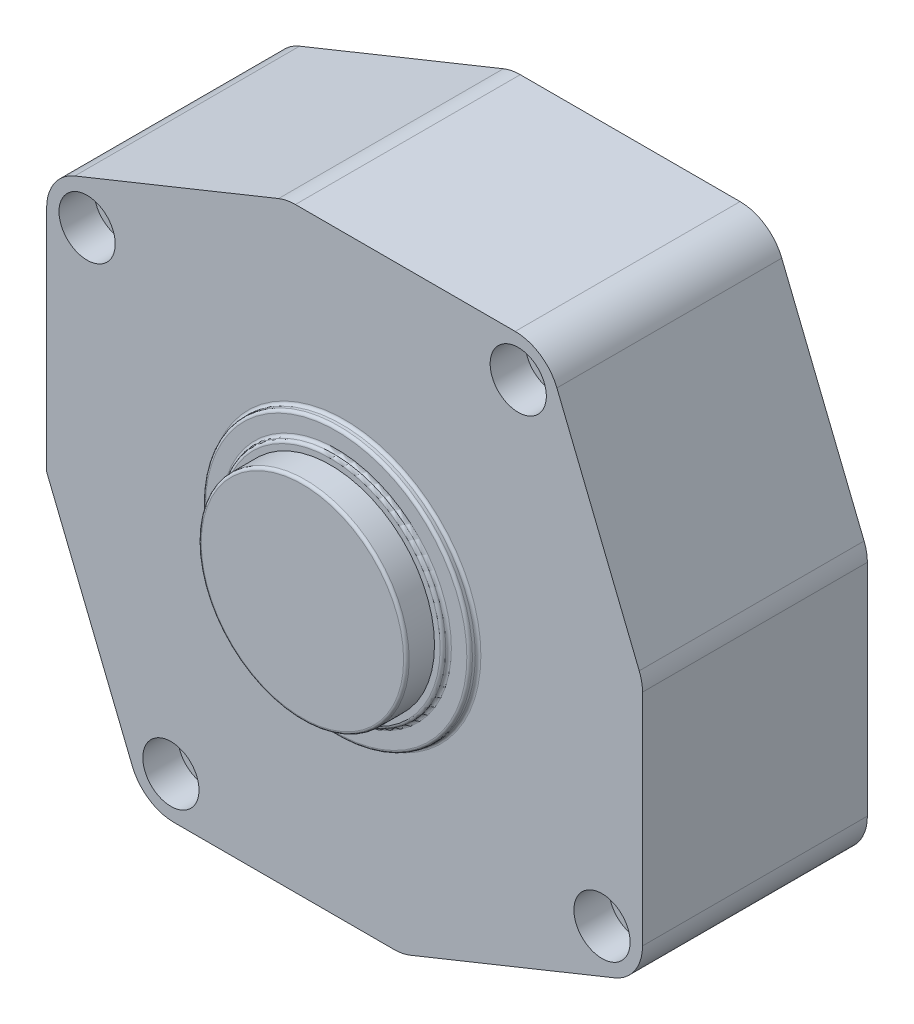
ISO-10303-21;
HEADER;
FILE_DESCRIPTION(('STEP AP214'),'2;1');
FILE_NAME('part.step','',(''),(''),'','','');
FILE_SCHEMA(('AUTOMOTIVE_DESIGN { 1 0 10303 214 1 1 1 1 }'));
ENDSEC;
DATA;
#1=APPLICATION_CONTEXT('core data for automotive mechanical design processes');
#2=APPLICATION_PROTOCOL_DEFINITION('international standard','automotive_design',2000,#1);
#3=PRODUCT_CONTEXT('',#1,'mechanical');
#4=PRODUCT('Part','Part','',(#3));
#5=PRODUCT_RELATED_PRODUCT_CATEGORY('part','',(#4));
#6=PRODUCT_DEFINITION_FORMATION('','',#4);
#7=PRODUCT_DEFINITION_CONTEXT('part definition',#1,'design');
#8=PRODUCT_DEFINITION('design','',#6,#7);
#9=PRODUCT_DEFINITION_SHAPE('','',#8);
#10=(LENGTH_UNIT() NAMED_UNIT(*) SI_UNIT(.MILLI.,.METRE.));
#11=(NAMED_UNIT(*) PLANE_ANGLE_UNIT() SI_UNIT($,.RADIAN.));
#12=(NAMED_UNIT(*) SI_UNIT($,.STERADIAN.) SOLID_ANGLE_UNIT());
#13=UNCERTAINTY_MEASURE_WITH_UNIT(LENGTH_MEASURE(1.E-05),#10,'distance_accuracy_value','');
#14=(GEOMETRIC_REPRESENTATION_CONTEXT(3) GLOBAL_UNCERTAINTY_ASSIGNED_CONTEXT((#13)) GLOBAL_UNIT_ASSIGNED_CONTEXT((#10,
#11,#12)) REPRESENTATION_CONTEXT('',''));
#15=CARTESIAN_POINT('',(0.,0.,0.));
#16=DIRECTION('',(0.,0.,1.));
#17=DIRECTION('',(1.,0.,0.));
#18=AXIS2_PLACEMENT_3D('',#15,#16,#17);
#19=CARTESIAN_POINT('',(41.91,-85.725,25.7175));
#20=DIRECTION('',(0.,0.,1.));
#21=DIRECTION('',(1.,0.,0.));
#22=AXIS2_PLACEMENT_3D('',#19,#20,#21);
#23=PLANE('',#22);
#24=CARTESIAN_POINT('',(41.91,-85.725,25.7175));
#25=DIRECTION('',(0.,0.,-1.));
#26=DIRECTION('',(1.,0.,0.));
#27=AXIS2_PLACEMENT_3D('',#24,#25,#26);
#28=CIRCLE('',#27,9.144);
#29=CARTESIAN_POINT('',(51.054,-85.725,25.7175));
#30=VERTEX_POINT('',#29);
#31=CARTESIAN_POINT('',(32.766,-85.725,25.7175));
#32=VERTEX_POINT('',#31);
#33=EDGE_CURVE('E644',#30,#32,#28,.T.);
#34=ORIENTED_EDGE('',*,*,#33,.F.);
#35=CARTESIAN_POINT('',(41.91,-85.725,25.7175));
#36=DIRECTION('',(0.,0.,-1.));
#37=DIRECTION('',(-1.,0.,0.));
#38=AXIS2_PLACEMENT_3D('',#35,#36,#37);
#39=CIRCLE('',#38,9.144);
#40=EDGE_CURVE('E648',#32,#30,#39,.T.);
#41=ORIENTED_EDGE('',*,*,#40,.F.);
#42=EDGE_LOOP('',(#34,#41));
#43=FACE_BOUND('',#42,.T.);
#44=ADVANCED_FACE('F16',(#43),#23,.T.);
#45=CARTESIAN_POINT('',(41.91,-85.725,25.4635));
#46=DIRECTION('',(0.,0.,1.));
#47=DIRECTION('',(1.,0.,0.));
#48=AXIS2_PLACEMENT_3D('',#45,#46,#47);
#49=TOROIDAL_SURFACE('',#48,9.144,0.254);
#50=CARTESIAN_POINT('',(41.91,-85.725,25.4635));
#51=DIRECTION('',(0.,0.,1.));
#52=DIRECTION('',(1.,0.,0.));
#53=AXIS2_PLACEMENT_3D('',#50,#51,#52);
#54=CIRCLE('',#53,9.398);
#55=CARTESIAN_POINT('',(51.308,-85.725,25.4635));
#56=VERTEX_POINT('',#55);
#57=EDGE_CURVE('E654',#56,#56,#54,.F.);
#58=ORIENTED_EDGE('',*,*,#57,.F.);
#59=EDGE_LOOP('',(#58));
#60=FACE_BOUND('',#59,.T.);
#61=ORIENTED_EDGE('',*,*,#33,.T.);
#62=ORIENTED_EDGE('',*,*,#40,.T.);
#63=EDGE_LOOP('',(#61,#62));
#64=FACE_BOUND('',#63,.T.);
#65=ADVANCED_FACE('F617',(#60,#64),#49,.T.);
#66=CARTESIAN_POINT('',(41.91,-85.725,21.9075));
#67=DIRECTION('',(0.,0.,1.));
#68=DIRECTION('',(1.,0.,0.));
#69=AXIS2_PLACEMENT_3D('',#66,#67,#68);
#70=CYLINDRICAL_SURFACE('',#69,9.398);
#71=CARTESIAN_POINT('',(41.91,-85.725,23.1775));
#72=DIRECTION('',(0.,0.,1.));
#73=DIRECTION('',(1.,0.,0.));
#74=AXIS2_PLACEMENT_3D('',#71,#72,#73);
#75=CIRCLE('',#74,9.398);
#76=CARTESIAN_POINT('',(51.308,-85.725,23.1775));
#77=VERTEX_POINT('',#76);
#78=EDGE_CURVE('E20',#77,#77,#75,.F.);
#79=ORIENTED_EDGE('',*,*,#78,.F.);
#80=EDGE_LOOP('',(#79));
#81=FACE_BOUND('',#80,.T.);
#82=ORIENTED_EDGE('',*,*,#57,.T.);
#83=EDGE_LOOP('',(#82));
#84=FACE_BOUND('',#83,.T.);
#85=ADVANCED_FACE('F608',(#81,#84),#70,.T.);
#86=CARTESIAN_POINT('',(41.91,-85.725,23.1775));
#87=DIRECTION('',(0.,0.,1.));
#88=DIRECTION('',(1.,0.,0.));
#89=AXIS2_PLACEMENT_3D('',#86,#87,#88);
#90=PLANE('',#89);
#91=ORIENTED_EDGE('',*,*,#78,.T.);
#92=EDGE_LOOP('',(#91));
#93=FACE_BOUND('',#92,.T.);
#94=CARTESIAN_POINT('',(41.91,-85.725,23.1775));
#95=DIRECTION('',(0.,0.,-1.));
#96=DIRECTION('',(1.,0.,0.));
#97=AXIS2_PLACEMENT_3D('',#94,#95,#96);
#98=CIRCLE('',#97,9.90600000000001);
#99=CARTESIAN_POINT('',(51.816,-85.725,23.1775));
#100=VERTEX_POINT('',#99);
#101=CARTESIAN_POINT('',(32.004,-85.725,23.1775));
#102=VERTEX_POINT('',#101);
#103=EDGE_CURVE('E817',#100,#102,#98,.T.);
#104=ORIENTED_EDGE('',*,*,#103,.F.);
#105=CARTESIAN_POINT('',(41.91,-85.725,23.1775));
#106=DIRECTION('',(0.,0.,-1.));
#107=DIRECTION('',(-1.,0.,0.));
#108=AXIS2_PLACEMENT_3D('',#105,#106,#107);
#109=CIRCLE('',#108,9.906);
#110=EDGE_CURVE('E819',#102,#100,#109,.T.);
#111=ORIENTED_EDGE('',*,*,#110,.F.);
#112=EDGE_LOOP('',(#104,#111));
#113=FACE_BOUND('',#112,.T.);
#114=ADVANCED_FACE('F599',(#93,#113),#90,.T.);
#115=CARTESIAN_POINT('',(41.91,-85.725,22.9235));
#116=DIRECTION('',(0.,0.,1.));
#117=DIRECTION('',(1.,0.,0.));
#118=AXIS2_PLACEMENT_3D('',#115,#116,#117);
#119=TOROIDAL_SURFACE('',#118,9.906,0.254);
#120=CARTESIAN_POINT('',(41.91,-85.725,22.9235));
#121=DIRECTION('',(0.,0.,1.));
#122=DIRECTION('',(1.,0.,0.));
#123=AXIS2_PLACEMENT_3D('',#120,#121,#122);
#124=CIRCLE('',#123,10.16);
#125=CARTESIAN_POINT('',(52.07,-85.725,22.9235));
#126=VERTEX_POINT('',#125);
#127=EDGE_CURVE('E795',#126,#126,#124,.T.);
#128=ORIENTED_EDGE('',*,*,#127,.T.);
#129=EDGE_LOOP('',(#128));
#130=FACE_BOUND('',#129,.T.);
#131=ORIENTED_EDGE('',*,*,#103,.T.);
#132=ORIENTED_EDGE('',*,*,#110,.T.);
#133=EDGE_LOOP('',(#131,#132));
#134=FACE_BOUND('',#133,.T.);
#135=ADVANCED_FACE('F278',(#130,#134),#119,.T.);
#136=CARTESIAN_POINT('',(41.91,-85.725,22.9235));
#137=DIRECTION('',(0.,0.,1.));
#138=DIRECTION('',(1.,0.,0.));
#139=AXIS2_PLACEMENT_3D('',#136,#137,#138);
#140=TOROIDAL_SURFACE('',#139,10.414,0.254);
#141=ORIENTED_EDGE('',*,*,#127,.F.);
#142=EDGE_LOOP('',(#141));
#143=FACE_BOUND('',#142,.T.);
#144=CARTESIAN_POINT('',(41.91,-85.725,22.6695));
#145=DIRECTION('',(0.,0.,1.));
#146=DIRECTION('',(1.,0.,0.));
#147=AXIS2_PLACEMENT_3D('',#144,#145,#146);
#148=CIRCLE('',#147,10.414);
#149=CARTESIAN_POINT('',(31.496,-85.725,22.6695));
#150=VERTEX_POINT('',#149);
#151=CARTESIAN_POINT('',(52.324,-85.725,22.6695));
#152=VERTEX_POINT('',#151);
#153=EDGE_CURVE('E789',#150,#152,#148,.F.);
#154=ORIENTED_EDGE('',*,*,#153,.F.);
#155=CARTESIAN_POINT('',(41.91,-85.725,22.6695));
#156=DIRECTION('',(0.,0.,1.));
#157=DIRECTION('',(-1.,0.,0.));
#158=AXIS2_PLACEMENT_3D('',#155,#156,#157);
#159=CIRCLE('',#158,10.414);
#160=EDGE_CURVE('E270',#152,#150,#159,.F.);
#161=ORIENTED_EDGE('',*,*,#160,.F.);
#162=EDGE_LOOP('',(#154,#161));
#163=FACE_BOUND('',#162,.T.);
#164=ADVANCED_FACE('F272',(#143,#163),#140,.F.);
#165=CARTESIAN_POINT('',(41.91,-85.725,22.6695));
#166=DIRECTION('',(0.,0.,1.));
#167=DIRECTION('',(1.,0.,0.));
#168=AXIS2_PLACEMENT_3D('',#165,#166,#167);
#169=PLANE('',#168);
#170=ORIENTED_EDGE('',*,*,#153,.T.);
#171=ORIENTED_EDGE('',*,*,#160,.T.);
#172=EDGE_LOOP('',(#170,#171));
#173=FACE_BOUND('',#172,.T.);
#174=CARTESIAN_POINT('',(41.91,-85.725,22.6695));
#175=DIRECTION('',(0.,0.,-1.));
#176=DIRECTION('',(1.,0.,0.));
#177=AXIS2_PLACEMENT_3D('',#174,#175,#176);
#178=CIRCLE('',#177,11.811);
#179=CARTESIAN_POINT('',(53.721,-85.725,22.6695));
#180=VERTEX_POINT('',#179);
#181=CARTESIAN_POINT('',(30.099,-85.725,22.6695));
#182=VERTEX_POINT('',#181);
#183=EDGE_CURVE('E227',#180,#182,#178,.T.);
#184=ORIENTED_EDGE('',*,*,#183,.F.);
#185=CARTESIAN_POINT('',(41.91,-85.725,22.6695));
#186=DIRECTION('',(0.,0.,-1.));
#187=DIRECTION('',(-1.,0.,0.));
#188=AXIS2_PLACEMENT_3D('',#185,#186,#187);
#189=CIRCLE('',#188,11.811);
#190=EDGE_CURVE('E265',#182,#180,#189,.T.);
#191=ORIENTED_EDGE('',*,*,#190,.F.);
#192=EDGE_LOOP('',(#184,#191));
#193=FACE_BOUND('',#192,.T.);
#194=ADVANCED_FACE('F239',(#173,#193),#169,.T.);
#195=CARTESIAN_POINT('',(41.91,-85.725,22.4155));
#196=DIRECTION('',(0.,0.,1.));
#197=DIRECTION('',(1.,0.,0.));
#198=AXIS2_PLACEMENT_3D('',#195,#196,#197);
#199=TOROIDAL_SURFACE('',#198,11.811,0.254);
#200=CARTESIAN_POINT('',(41.91,-85.725,22.4155));
#201=DIRECTION('',(0.,0.,1.));
#202=DIRECTION('',(1.,0.,0.));
#203=AXIS2_PLACEMENT_3D('',#200,#201,#202);
#204=CIRCLE('',#203,12.065);
#205=CARTESIAN_POINT('',(53.975,-85.725,22.4155));
#206=VERTEX_POINT('',#205);
#207=EDGE_CURVE('E216',#206,#206,#204,.F.);
#208=ORIENTED_EDGE('',*,*,#207,.F.);
#209=EDGE_LOOP('',(#208));
#210=FACE_BOUND('',#209,.T.);
#211=ORIENTED_EDGE('',*,*,#183,.T.);
#212=ORIENTED_EDGE('',*,*,#190,.T.);
#213=EDGE_LOOP('',(#211,#212));
#214=FACE_BOUND('',#213,.T.);
#215=ADVANCED_FACE('F233',(#210,#214),#199,.T.);
#216=CARTESIAN_POINT('',(41.91,-85.725,21.9075));
#217=DIRECTION('',(0.,0.,1.));
#218=DIRECTION('',(1.,0.,0.));
#219=AXIS2_PLACEMENT_3D('',#216,#217,#218);
#220=CYLINDRICAL_SURFACE('',#219,12.065);
#221=CARTESIAN_POINT('',(41.91,-85.725,22.1615));
#222=DIRECTION('',(0.,0.,-1.));
#223=DIRECTION('',(-1.,0.,0.));
#224=AXIS2_PLACEMENT_3D('',#221,#222,#223);
#225=CIRCLE('',#224,12.065);
#226=CARTESIAN_POINT('',(29.845,-85.725,22.1615));
#227=VERTEX_POINT('',#226);
#228=EDGE_CURVE('E212',#227,#227,#225,.F.);
#229=ORIENTED_EDGE('',*,*,#228,.T.);
#230=EDGE_LOOP('',(#229));
#231=FACE_BOUND('',#230,.T.);
#232=ORIENTED_EDGE('',*,*,#207,.T.);
#233=EDGE_LOOP('',(#232));
#234=FACE_BOUND('',#233,.T.);
#235=ADVANCED_FACE('F238',(#231,#234),#220,.T.);
#236=CARTESIAN_POINT('',(26.217201580465,-108.990530423541,18.7325));
#237=DIRECTION('',(0.,0.,1.));
#238=DIRECTION('',(1.,0.,0.));
#239=AXIS2_PLACEMENT_3D('',#236,#237,#238);
#240=PLANE('',#239);
#241=CARTESIAN_POINT('',(26.217201580465,-108.990530423541,18.7325));
#242=DIRECTION('',(0.,0.,-1.));
#243=DIRECTION('',(-1.,0.,0.));
#244=AXIS2_PLACEMENT_3D('',#241,#242,#243);
#245=CIRCLE('',#244,2.54);
#246=CARTESIAN_POINT('',(23.677201580465,-108.990530423541,18.7325));
#247=VERTEX_POINT('',#246);
#248=EDGE_CURVE('E215',#247,#247,#245,.F.);
#249=ORIENTED_EDGE('',*,*,#248,.T.);
#250=EDGE_LOOP('',(#249));
#251=FACE_BOUND('',#250,.T.);
#252=ADVANCED_FACE('F390',(#251),#240,.T.);
#253=CARTESIAN_POINT('',(18.6444695764577,-70.032201580464,18.7325));
#254=DIRECTION('',(0.,0.,1.));
#255=DIRECTION('',(1.,0.,0.));
#256=AXIS2_PLACEMENT_3D('',#253,#254,#255);
#257=PLANE('',#256);
#258=CARTESIAN_POINT('',(18.6444695764577,-70.032201580464,18.7325));
#259=DIRECTION('',(0.,0.,-1.));
#260=DIRECTION('',(-1.,0.,0.));
#261=AXIS2_PLACEMENT_3D('',#258,#259,#260);
#262=CIRCLE('',#261,2.54);
#263=CARTESIAN_POINT('',(16.1044695764577,-70.032201580464,18.7325));
#264=VERTEX_POINT('',#263);
#265=EDGE_CURVE('E385',#264,#264,#262,.F.);
#266=ORIENTED_EDGE('',*,*,#265,.T.);
#267=EDGE_LOOP('',(#266));
#268=FACE_BOUND('',#267,.T.);
#269=ADVANCED_FACE('F395',(#268),#257,.T.);
#270=CARTESIAN_POINT('',(65.1755304235415,-101.417798419535,18.7325));
#271=DIRECTION('',(0.,0.,1.));
#272=DIRECTION('',(1.,0.,0.));
#273=AXIS2_PLACEMENT_3D('',#270,#271,#272);
#274=PLANE('',#273);
#275=CARTESIAN_POINT('',(65.1755304235415,-101.417798419535,18.7325));
#276=DIRECTION('',(0.,0.,-1.));
#277=DIRECTION('',(-1.,0.,0.));
#278=AXIS2_PLACEMENT_3D('',#275,#276,#277);
#279=CIRCLE('',#278,2.54);
#280=CARTESIAN_POINT('',(62.6355304235415,-101.417798419535,18.7325));
#281=VERTEX_POINT('',#280);
#282=EDGE_CURVE('E382',#281,#281,#279,.F.);
#283=ORIENTED_EDGE('',*,*,#282,.T.);
#284=EDGE_LOOP('',(#283));
#285=FACE_BOUND('',#284,.T.);
#286=ADVANCED_FACE('F400',(#285),#274,.T.);
#287=CARTESIAN_POINT('',(57.602798419536,-62.4594695764574,18.7325));
#288=DIRECTION('',(0.,0.,1.));
#289=DIRECTION('',(1.,0.,0.));
#290=AXIS2_PLACEMENT_3D('',#287,#288,#289);
#291=PLANE('',#290);
#292=CARTESIAN_POINT('',(57.602798419536,-62.4594695764574,18.7325));
#293=DIRECTION('',(0.,0.,-1.));
#294=DIRECTION('',(-1.,0.,0.));
#295=AXIS2_PLACEMENT_3D('',#292,#293,#294);
#296=CIRCLE('',#295,2.54);
#297=CARTESIAN_POINT('',(55.062798419536,-62.4594695764574,18.7325));
#298=VERTEX_POINT('',#297);
#299=EDGE_CURVE('E379',#298,#298,#296,.F.);
#300=ORIENTED_EDGE('',*,*,#299,.T.);
#301=EDGE_LOOP('',(#300));
#302=FACE_BOUND('',#301,.T.);
#303=ADVANCED_FACE('F203',(#302),#291,.T.);
#304=CARTESIAN_POINT('',(41.91,-85.725,22.1615));
#305=DIRECTION('',(0.,0.,-1.));
#306=DIRECTION('',(-1.,0.,0.));
#307=AXIS2_PLACEMENT_3D('',#304,#305,#306);
#308=TOROIDAL_SURFACE('',#307,12.319,0.254);
#309=CARTESIAN_POINT('',(41.91,-85.725,21.9075));
#310=DIRECTION('',(0.,0.,1.));
#311=DIRECTION('',(1.,0.,0.));
#312=AXIS2_PLACEMENT_3D('',#309,#310,#311);
#313=CIRCLE('',#312,12.319);
#314=CARTESIAN_POINT('',(54.229,-85.725,21.9075));
#315=VERTEX_POINT('',#314);
#316=EDGE_CURVE('E153',#315,#315,#313,.F.);
#317=ORIENTED_EDGE('',*,*,#316,.F.);
#318=EDGE_LOOP('',(#317));
#319=FACE_BOUND('',#318,.T.);
#320=ORIENTED_EDGE('',*,*,#228,.F.);
#321=EDGE_LOOP('',(#320));
#322=FACE_BOUND('',#321,.T.);
#323=ADVANCED_FACE('F197',(#319,#322),#308,.F.);
#324=CARTESIAN_POINT('',(26.217201580465,-108.990530423541,21.9075));
#325=DIRECTION('',(0.,0.,-1.));
#326=DIRECTION('',(-1.,0.,0.));
#327=AXIS2_PLACEMENT_3D('',#324,#325,#326);
#328=CYLINDRICAL_SURFACE('',#327,2.54);
#329=ORIENTED_EDGE('',*,*,#248,.F.);
#330=EDGE_LOOP('',(#329));
#331=FACE_BOUND('',#330,.T.);
#332=CARTESIAN_POINT('',(26.217201580465,-108.990530423541,21.9075));
#333=DIRECTION('',(0.,0.,-1.));
#334=DIRECTION('',(-1.,0.,0.));
#335=AXIS2_PLACEMENT_3D('',#332,#333,#334);
#336=CIRCLE('',#335,2.54);
#337=CARTESIAN_POINT('',(23.677201580465,-108.990530423541,21.9075));
#338=VERTEX_POINT('',#337);
#339=EDGE_CURVE('E369',#338,#338,#336,.T.);
#340=ORIENTED_EDGE('',*,*,#339,.F.);
#341=EDGE_LOOP('',(#340));
#342=FACE_BOUND('',#341,.T.);
#343=ADVANCED_FACE('F193',(#331,#342),#328,.F.);
#344=CARTESIAN_POINT('',(18.6444695764577,-70.032201580464,21.9075));
#345=DIRECTION('',(0.,0.,-1.));
#346=DIRECTION('',(-1.,0.,0.));
#347=AXIS2_PLACEMENT_3D('',#344,#345,#346);
#348=CYLINDRICAL_SURFACE('',#347,2.54);
#349=ORIENTED_EDGE('',*,*,#265,.F.);
#350=EDGE_LOOP('',(#349));
#351=FACE_BOUND('',#350,.T.);
#352=CARTESIAN_POINT('',(18.6444695764577,-70.032201580464,21.9075));
#353=DIRECTION('',(0.,0.,-1.));
#354=DIRECTION('',(-1.,0.,0.));
#355=AXIS2_PLACEMENT_3D('',#352,#353,#354);
#356=CIRCLE('',#355,2.54);
#357=CARTESIAN_POINT('',(16.1044695764577,-70.032201580464,21.9075));
#358=VERTEX_POINT('',#357);
#359=EDGE_CURVE('E366',#358,#358,#356,.T.);
#360=ORIENTED_EDGE('',*,*,#359,.F.);
#361=EDGE_LOOP('',(#360));
#362=FACE_BOUND('',#361,.T.);
#363=ADVANCED_FACE('F189',(#351,#362),#348,.F.);
#364=CARTESIAN_POINT('',(65.1755304235415,-101.417798419535,21.9075));
#365=DIRECTION('',(0.,0.,-1.));
#366=DIRECTION('',(-1.,0.,0.));
#367=AXIS2_PLACEMENT_3D('',#364,#365,#366);
#368=CYLINDRICAL_SURFACE('',#367,2.54);
#369=ORIENTED_EDGE('',*,*,#282,.F.);
#370=EDGE_LOOP('',(#369));
#371=FACE_BOUND('',#370,.T.);
#372=CARTESIAN_POINT('',(65.1755304235415,-101.417798419535,21.9075));
#373=DIRECTION('',(0.,0.,-1.));
#374=DIRECTION('',(-1.,0.,0.));
#375=AXIS2_PLACEMENT_3D('',#372,#373,#374);
#376=CIRCLE('',#375,2.54);
#377=CARTESIAN_POINT('',(62.6355304235415,-101.417798419535,21.9075));
#378=VERTEX_POINT('',#377);
#379=EDGE_CURVE('E363',#378,#378,#376,.T.);
#380=ORIENTED_EDGE('',*,*,#379,.F.);
#381=EDGE_LOOP('',(#380));
#382=FACE_BOUND('',#381,.T.);
#383=ADVANCED_FACE('F185',(#371,#382),#368,.F.);
#384=CARTESIAN_POINT('',(57.602798419536,-62.4594695764574,21.9075));
#385=DIRECTION('',(0.,0.,-1.));
#386=DIRECTION('',(-1.,0.,0.));
#387=AXIS2_PLACEMENT_3D('',#384,#385,#386);
#388=CYLINDRICAL_SURFACE('',#387,2.54);
#389=ORIENTED_EDGE('',*,*,#299,.F.);
#390=EDGE_LOOP('',(#389));
#391=FACE_BOUND('',#390,.T.);
#392=CARTESIAN_POINT('',(57.602798419536,-62.4594695764574,21.9075));
#393=DIRECTION('',(0.,0.,-1.));
#394=DIRECTION('',(-1.,0.,0.));
#395=AXIS2_PLACEMENT_3D('',#392,#393,#394);
#396=CIRCLE('',#395,2.54);
#397=CARTESIAN_POINT('',(55.062798419536,-62.4594695764574,21.9075));
#398=VERTEX_POINT('',#397);
#399=EDGE_CURVE('E360',#398,#398,#396,.T.);
#400=ORIENTED_EDGE('',*,*,#399,.F.);
#401=EDGE_LOOP('',(#400));
#402=FACE_BOUND('',#401,.T.);
#403=ADVANCED_FACE('F181',(#391,#402),#388,.F.);
#404=CARTESIAN_POINT('',(46.3535338668883,-108.585,1.5875));
#405=DIRECTION('',(0.,0.,1.));
#406=DIRECTION('',(1.,0.,0.));
#407=AXIS2_PLACEMENT_3D('',#404,#405,#406);
#408=CYLINDRICAL_SURFACE('',#407,4.064);
#409=CARTESIAN_POINT('',(46.3535338668883,-108.585,1.5875));
#410=DIRECTION('',(0.,0.,1.));
#411=DIRECTION('',(1.,0.,0.));
#412=AXIS2_PLACEMENT_3D('',#409,#410,#411);
#413=CIRCLE('',#412,4.064);
#414=CARTESIAN_POINT('',(46.3535338668883,-112.649,1.5875));
#415=VERTEX_POINT('',#414);
#416=CARTESIAN_POINT('',(47.8759350625305,-112.353075184959,1.5875));
#417=VERTEX_POINT('',#416);
#418=EDGE_CURVE('E60',#415,#417,#413,.T.);
#419=ORIENTED_EDGE('',*,*,#418,.T.);
#420=DIRECTION('',(0.,0.,1.));
#421=VECTOR('',#420,1.);
#422=CARTESIAN_POINT('',(47.8759350625304,-112.353075184959,1.5875));
#423=LINE('',#422,#421);
#424=CARTESIAN_POINT('',(47.8759350625305,-112.353075184959,21.9075));
#425=VERTEX_POINT('',#424);
#426=EDGE_CURVE('E731',#425,#417,#423,.F.);
#427=ORIENTED_EDGE('',*,*,#426,.F.);
#428=CARTESIAN_POINT('',(46.3535338668883,-108.585,21.9075));
#429=DIRECTION('',(0.,0.,1.));
#430=DIRECTION('',(1.,0.,0.));
#431=AXIS2_PLACEMENT_3D('',#428,#429,#430);
#432=CIRCLE('',#431,4.064);
#433=CARTESIAN_POINT('',(46.3535338668883,-112.649,21.9075));
#434=VERTEX_POINT('',#433);
#435=EDGE_CURVE('E136',#434,#425,#432,.T.);
#436=ORIENTED_EDGE('',*,*,#435,.F.);
#437=DIRECTION('',(0.,0.,-1.));
#438=VECTOR('',#437,1.);
#439=CARTESIAN_POINT('',(46.3535338668883,-112.649,1.5875));
#440=LINE('',#439,#438);
#441=EDGE_CURVE('E735',#415,#434,#440,.F.);
#442=ORIENTED_EDGE('',*,*,#441,.F.);
#443=EDGE_LOOP('',(#419,#427,#436,#442));
#444=FACE_BOUND('',#443,.T.);
#445=ADVANCED_FACE('F177',(#444),#408,.T.);
#446=CARTESIAN_POINT('',(64.77,-81.2814661331117,1.5875));
#447=DIRECTION('',(0.,0.,1.));
#448=DIRECTION('',(1.,0.,0.));
#449=AXIS2_PLACEMENT_3D('',#446,#447,#448);
#450=CYLINDRICAL_SURFACE('',#449,4.064);
#451=CARTESIAN_POINT('',(64.77,-81.2814661331117,1.5875));
#452=DIRECTION('',(0.,0.,1.));
#453=DIRECTION('',(1.,0.,0.));
#454=AXIS2_PLACEMENT_3D('',#451,#452,#453);
#455=CIRCLE('',#454,4.064);
#456=CARTESIAN_POINT('',(68.834,-81.2814661331117,1.5875));
#457=VERTEX_POINT('',#456);
#458=CARTESIAN_POINT('',(68.5380751849594,-79.7590649374695,1.5875));
#459=VERTEX_POINT('',#458);
#460=EDGE_CURVE('E376',#457,#459,#455,.T.);
#461=ORIENTED_EDGE('',*,*,#460,.T.);
#462=DIRECTION('',(0.,0.,1.));
#463=VECTOR('',#462,1.);
#464=CARTESIAN_POINT('',(68.5380751849594,-79.7590649374696,1.5875));
#465=LINE('',#464,#463);
#466=CARTESIAN_POINT('',(68.5380751849594,-79.7590649374695,21.9075));
#467=VERTEX_POINT('',#466);
#468=EDGE_CURVE('E721',#467,#459,#465,.F.);
#469=ORIENTED_EDGE('',*,*,#468,.F.);
#470=CARTESIAN_POINT('',(64.77,-81.2814661331117,21.9075));
#471=DIRECTION('',(0.,0.,1.));
#472=DIRECTION('',(1.,0.,0.));
#473=AXIS2_PLACEMENT_3D('',#470,#471,#472);
#474=CIRCLE('',#473,4.064);
#475=CARTESIAN_POINT('',(68.834,-81.2814661331117,21.9075));
#476=VERTEX_POINT('',#475);
#477=EDGE_CURVE('E372',#476,#467,#474,.T.);
#478=ORIENTED_EDGE('',*,*,#477,.F.);
#479=DIRECTION('',(0.,0.,1.));
#480=VECTOR('',#479,1.);
#481=CARTESIAN_POINT('',(68.834,-81.2814661331117,1.5875));
#482=LINE('',#481,#480);
#483=EDGE_CURVE('E728',#457,#476,#482,.T.);
#484=ORIENTED_EDGE('',*,*,#483,.F.);
#485=EDGE_LOOP('',(#461,#469,#478,#484));
#486=FACE_BOUND('',#485,.T.);
#487=ADVANCED_FACE('F174',(#486),#450,.T.);
#488=CARTESIAN_POINT('',(37.4664661331117,-62.865,1.5875));
#489=DIRECTION('',(0.,0.,1.));
#490=DIRECTION('',(1.,0.,0.));
#491=AXIS2_PLACEMENT_3D('',#488,#489,#490);
#492=CYLINDRICAL_SURFACE('',#491,4.064);
#493=CARTESIAN_POINT('',(37.4664661331117,-62.865,1.5875));
#494=DIRECTION('',(0.,0.,1.));
#495=DIRECTION('',(1.,0.,0.));
#496=AXIS2_PLACEMENT_3D('',#493,#494,#495);
#497=CIRCLE('',#496,4.064);
#498=CARTESIAN_POINT('',(37.4664661331117,-58.801,1.5875));
#499=VERTEX_POINT('',#498);
#500=CARTESIAN_POINT('',(35.9440649374695,-59.0969248150405,1.5875));
#501=VERTEX_POINT('',#500);
#502=EDGE_CURVE('E35',#499,#501,#497,.T.);
#503=ORIENTED_EDGE('',*,*,#502,.T.);
#504=DIRECTION('',(0.,0.,1.));
#505=VECTOR('',#504,1.);
#506=CARTESIAN_POINT('',(35.9440649374696,-59.0969248150406,1.5875));
#507=LINE('',#506,#505);
#508=CARTESIAN_POINT('',(35.9440649374695,-59.0969248150406,21.9075));
#509=VERTEX_POINT('',#508);
#510=EDGE_CURVE('E132',#509,#501,#507,.F.);
#511=ORIENTED_EDGE('',*,*,#510,.F.);
#512=CARTESIAN_POINT('',(37.4664661331117,-62.865,21.9075));
#513=DIRECTION('',(0.,0.,1.));
#514=DIRECTION('',(1.,0.,0.));
#515=AXIS2_PLACEMENT_3D('',#512,#513,#514);
#516=CIRCLE('',#515,4.064);
#517=CARTESIAN_POINT('',(37.4664661331117,-58.801,21.9075));
#518=VERTEX_POINT('',#517);
#519=EDGE_CURVE('E129',#518,#509,#516,.T.);
#520=ORIENTED_EDGE('',*,*,#519,.F.);
#521=DIRECTION('',(0.,0.,1.));
#522=VECTOR('',#521,1.);
#523=CARTESIAN_POINT('',(37.4664661331117,-58.801,1.5875));
#524=LINE('',#523,#522);
#525=EDGE_CURVE('E118',#499,#518,#524,.T.);
#526=ORIENTED_EDGE('',*,*,#525,.F.);
#527=EDGE_LOOP('',(#503,#511,#520,#526));
#528=FACE_BOUND('',#527,.T.);
#529=ADVANCED_FACE('F130',(#528),#492,.T.);
#530=CARTESIAN_POINT('',(41.91,-85.725,21.9075));
#531=DIRECTION('',(0.,0.,1.));
#532=DIRECTION('',(1.,0.,0.));
#533=AXIS2_PLACEMENT_3D('',#530,#531,#532);
#534=PLANE('',#533);
#535=ORIENTED_EDGE('',*,*,#399,.T.);
#536=EDGE_LOOP('',(#535));
#537=FACE_BOUND('',#536,.T.);
#538=ORIENTED_EDGE('',*,*,#379,.T.);
#539=EDGE_LOOP('',(#538));
#540=FACE_BOUND('',#539,.T.);
#541=ORIENTED_EDGE('',*,*,#359,.T.);
#542=EDGE_LOOP('',(#541));
#543=FACE_BOUND('',#542,.T.);
#544=ORIENTED_EDGE('',*,*,#339,.T.);
#545=EDGE_LOOP('',(#544));
#546=FACE_BOUND('',#545,.T.);
#547=ORIENTED_EDGE('',*,*,#316,.T.);
#548=EDGE_LOOP('',(#547));
#549=FACE_BOUND('',#548,.T.);
#550=CARTESIAN_POINT('',(57.3292646950178,-62.865,21.9075));
#551=DIRECTION('',(0.,0.,1.));
#552=DIRECTION('',(1.,0.,0.));
#553=AXIS2_PLACEMENT_3D('',#550,#551,#552);
#554=CIRCLE('',#553,4.064);
#555=CARTESIAN_POINT('',(57.3292646950178,-58.801,21.9075));
#556=VERTEX_POINT('',#555);
#557=CARTESIAN_POINT('',(61.0973398799772,-61.3425988043577,21.9075));
#558=VERTEX_POINT('',#557);
#559=EDGE_CURVE('E140',#556,#558,#554,.F.);
#560=ORIENTED_EDGE('',*,*,#559,.F.);
#561=DIRECTION('',(1.,0.,0.));
#562=VECTOR('',#561,1.);
#563=CARTESIAN_POINT('',(60.0704673074654,-58.801,21.9075));
#564=LINE('',#563,#562);
#565=EDGE_CURVE('E122',#518,#556,#564,.T.);
#566=ORIENTED_EDGE('',*,*,#565,.F.);
#567=ORIENTED_EDGE('',*,*,#519,.T.);
#568=DIRECTION('',(-0.927183854566788,-0.374606593415911,0.));
#569=VECTOR('',#568,1.);
#570=CARTESIAN_POINT('',(36.6765045567761,-58.801,21.9075));
#571=LINE('',#570,#569);
#572=CARTESIAN_POINT('',(17.5275988043577,-66.5376601200226,21.9075));
#573=VERTEX_POINT('',#572);
#574=EDGE_CURVE('E210',#573,#509,#571,.F.);
#575=ORIENTED_EDGE('',*,*,#574,.F.);
#576=CARTESIAN_POINT('',(19.05,-70.305735304982,21.9075));
#577=DIRECTION('',(0.,0.,1.));
#578=DIRECTION('',(1.,0.,0.));
#579=AXIS2_PLACEMENT_3D('',#576,#577,#578);
#580=CIRCLE('',#579,4.064);
#581=CARTESIAN_POINT('',(14.986,-70.305735304982,21.9075));
#582=VERTEX_POINT('',#581);
#583=EDGE_CURVE('E358',#582,#573,#580,.F.);
#584=ORIENTED_EDGE('',*,*,#583,.F.);
#585=DIRECTION('',(0.,1.,0.));
#586=VECTOR('',#585,1.);
#587=CARTESIAN_POINT('',(14.986,-67.5645326925346,21.9075));
#588=LINE('',#587,#586);
#589=CARTESIAN_POINT('',(14.986,-90.9584954432239,21.9075));
#590=VERTEX_POINT('',#589);
#591=EDGE_CURVE('E743',#590,#582,#588,.T.);
#592=ORIENTED_EDGE('',*,*,#591,.F.);
#593=DIRECTION('',(0.374606593415913,-0.927183854566787,0.));
#594=VECTOR('',#593,1.);
#595=CARTESIAN_POINT('',(14.986,-90.9584954432239,21.9075));
#596=LINE('',#595,#594);
#597=CARTESIAN_POINT('',(22.7226601200228,-110.107401195642,21.9075));
#598=VERTEX_POINT('',#597);
#599=EDGE_CURVE('E740',#598,#590,#596,.F.);
#600=ORIENTED_EDGE('',*,*,#599,.F.);
#601=CARTESIAN_POINT('',(26.4907353049822,-108.585,21.9075));
#602=DIRECTION('',(0.,0.,1.));
#603=DIRECTION('',(1.,0.,0.));
#604=AXIS2_PLACEMENT_3D('',#601,#602,#603);
#605=CIRCLE('',#604,4.064);
#606=CARTESIAN_POINT('',(26.4907353049822,-112.649,21.9075));
#607=VERTEX_POINT('',#606);
#608=EDGE_CURVE('E354',#607,#598,#605,.F.);
#609=ORIENTED_EDGE('',*,*,#608,.F.);
#610=DIRECTION('',(1.,0.,0.));
#611=VECTOR('',#610,1.);
#612=CARTESIAN_POINT('',(23.7495326925345,-112.649,21.9075));
#613=LINE('',#612,#611);
#614=EDGE_CURVE('E734',#434,#607,#613,.F.);
#615=ORIENTED_EDGE('',*,*,#614,.F.);
#616=ORIENTED_EDGE('',*,*,#435,.T.);
#617=DIRECTION('',(0.927183854566788,0.374606593415911,0.));
#618=VECTOR('',#617,1.);
#619=CARTESIAN_POINT('',(47.1434954432239,-112.649,21.9075));
#620=LINE('',#619,#618);
#621=CARTESIAN_POINT('',(66.2924011956423,-104.912339879977,21.9075));
#622=VERTEX_POINT('',#621);
#623=EDGE_CURVE('E353',#622,#425,#620,.F.);
#624=ORIENTED_EDGE('',*,*,#623,.F.);
#625=CARTESIAN_POINT('',(64.77,-101.144264695018,21.9075));
#626=DIRECTION('',(0.,0.,1.));
#627=DIRECTION('',(1.,0.,0.));
#628=AXIS2_PLACEMENT_3D('',#625,#626,#627);
#629=CIRCLE('',#628,4.064);
#630=CARTESIAN_POINT('',(68.834,-101.144264695018,21.9075));
#631=VERTEX_POINT('',#630);
#632=EDGE_CURVE('E350',#631,#622,#629,.F.);
#633=ORIENTED_EDGE('',*,*,#632,.F.);
#634=DIRECTION('',(0.,1.,0.));
#635=VECTOR('',#634,1.);
#636=CARTESIAN_POINT('',(68.834,-103.885467307465,21.9075));
#637=LINE('',#636,#635);
#638=EDGE_CURVE('E727',#476,#631,#637,.F.);
#639=ORIENTED_EDGE('',*,*,#638,.F.);
#640=ORIENTED_EDGE('',*,*,#477,.T.);
#641=DIRECTION('',(-0.374606593415913,0.927183854566787,0.));
#642=VECTOR('',#641,1.);
#643=CARTESIAN_POINT('',(68.834,-80.4915045567761,21.9075));
#644=LINE('',#643,#642);
#645=EDGE_CURVE('E158',#558,#467,#644,.F.);
#646=ORIENTED_EDGE('',*,*,#645,.F.);
#647=EDGE_LOOP('',(#560,#566,#567,#575,#584,#592,#600,#609,#615,#616,#624,#633,#639,#640,#646));
#648=FACE_BOUND('',#647,.T.);
#649=ADVANCED_FACE('F138',(#537,#540,#543,#546,#549,#648),#534,.T.);
#650=CARTESIAN_POINT('',(36.6765045567761,-58.801,1.5875));
#651=DIRECTION('',(-0.374606593415911,0.927183854566788,0.));
#652=DIRECTION('',(-0.927183854566788,-0.374606593415911,0.));
#653=AXIS2_PLACEMENT_3D('',#650,#651,#652);
#654=PLANE('',#653);
#655=DIRECTION('',(0.,0.,1.));
#656=VECTOR('',#655,1.);
#657=CARTESIAN_POINT('',(17.5275988043576,-66.5376601200226,1.5875));
#658=LINE('',#657,#656);
#659=CARTESIAN_POINT('',(17.5275988043577,-66.5376601200226,1.5875));
#660=VERTEX_POINT('',#659);
#661=EDGE_CURVE('E336',#573,#660,#658,.F.);
#662=ORIENTED_EDGE('',*,*,#661,.F.);
#663=ORIENTED_EDGE('',*,*,#574,.T.);
#664=ORIENTED_EDGE('',*,*,#510,.T.);
#665=DIRECTION('',(-0.927183854566786,-0.374606593415915,0.));
#666=VECTOR('',#665,1.);
#667=CARTESIAN_POINT('',(35.9440649374695,-59.0969248150405,1.5875));
#668=LINE('',#667,#666);
#669=EDGE_CURVE('E144',#501,#660,#668,.T.);
#670=ORIENTED_EDGE('',*,*,#669,.T.);
#671=EDGE_LOOP('',(#662,#663,#664,#670));
#672=FACE_BOUND('',#671,.T.);
#673=ADVANCED_FACE('F169',(#672),#654,.T.);
#674=CARTESIAN_POINT('',(19.05,-70.305735304982,1.5875));
#675=DIRECTION('',(0.,0.,1.));
#676=DIRECTION('',(1.,0.,0.));
#677=AXIS2_PLACEMENT_3D('',#674,#675,#676);
#678=CYLINDRICAL_SURFACE('',#677,4.064);
#679=CARTESIAN_POINT('',(19.05,-70.305735304982,1.5875));
#680=DIRECTION('',(0.,0.,1.));
#681=DIRECTION('',(1.,0.,0.));
#682=AXIS2_PLACEMENT_3D('',#679,#680,#681);
#683=CIRCLE('',#682,4.064);
#684=CARTESIAN_POINT('',(14.986,-70.305735304982,1.5875));
#685=VERTEX_POINT('',#684);
#686=EDGE_CURVE('E333',#660,#685,#683,.T.);
#687=ORIENTED_EDGE('',*,*,#686,.T.);
#688=DIRECTION('',(0.,0.,1.));
#689=VECTOR('',#688,1.);
#690=CARTESIAN_POINT('',(14.986,-70.305735304982,1.5875));
#691=LINE('',#690,#689);
#692=EDGE_CURVE('E334',#582,#685,#691,.F.);
#693=ORIENTED_EDGE('',*,*,#692,.F.);
#694=ORIENTED_EDGE('',*,*,#583,.T.);
#695=ORIENTED_EDGE('',*,*,#661,.T.);
#696=EDGE_LOOP('',(#687,#693,#694,#695));
#697=FACE_BOUND('',#696,.T.);
#698=ADVANCED_FACE('F322',(#697),#678,.T.);
#699=CARTESIAN_POINT('',(14.986,-67.5645326925346,1.5875));
#700=DIRECTION('',(-1.,0.,0.));
#701=DIRECTION('',(0.,0.,1.));
#702=AXIS2_PLACEMENT_3D('',#699,#700,#701);
#703=PLANE('',#702);
#704=DIRECTION('',(0.,0.,1.));
#705=VECTOR('',#704,1.);
#706=CARTESIAN_POINT('',(14.986,-90.9584954432239,1.5875));
#707=LINE('',#706,#705);
#708=CARTESIAN_POINT('',(14.986,-90.9584954432239,1.5875));
#709=VERTEX_POINT('',#708);
#710=EDGE_CURVE('E357',#590,#709,#707,.F.);
#711=ORIENTED_EDGE('',*,*,#710,.F.);
#712=ORIENTED_EDGE('',*,*,#591,.T.);
#713=ORIENTED_EDGE('',*,*,#692,.T.);
#714=DIRECTION('',(0.,1.,0.));
#715=VECTOR('',#714,1.);
#716=CARTESIAN_POINT('',(14.986,-85.725,1.5875));
#717=LINE('',#716,#715);
#718=EDGE_CURVE('E339',#685,#709,#717,.F.);
#719=ORIENTED_EDGE('',*,*,#718,.T.);
#720=EDGE_LOOP('',(#711,#712,#713,#719));
#721=FACE_BOUND('',#720,.T.);
#722=ADVANCED_FACE('F319',(#721),#703,.T.);
#723=CARTESIAN_POINT('',(14.986,-90.9584954432239,1.5875));
#724=DIRECTION('',(-0.927183854566787,-0.374606593415913,0.));
#725=DIRECTION('',(0.374606593415913,-0.927183854566787,0.));
#726=AXIS2_PLACEMENT_3D('',#723,#724,#725);
#727=PLANE('',#726);
#728=ORIENTED_EDGE('',*,*,#710,.T.);
#729=DIRECTION('',(0.374606593415911,-0.927183854566788,0.));
#730=VECTOR('',#729,1.);
#731=CARTESIAN_POINT('',(14.986,-90.9584954432239,1.5875));
#732=LINE('',#731,#730);
#733=CARTESIAN_POINT('',(22.7226601200227,-110.107401195642,1.5875));
#734=VERTEX_POINT('',#733);
#735=EDGE_CURVE('E342',#709,#734,#732,.T.);
#736=ORIENTED_EDGE('',*,*,#735,.T.);
#737=DIRECTION('',(0.,0.,1.));
#738=VECTOR('',#737,1.);
#739=CARTESIAN_POINT('',(22.7226601200228,-110.107401195642,1.5875));
#740=LINE('',#739,#738);
#741=EDGE_CURVE('E356',#598,#734,#740,.F.);
#742=ORIENTED_EDGE('',*,*,#741,.F.);
#743=ORIENTED_EDGE('',*,*,#599,.T.);
#744=EDGE_LOOP('',(#728,#736,#742,#743));
#745=FACE_BOUND('',#744,.T.);
#746=ADVANCED_FACE('F315',(#745),#727,.T.);
#747=CARTESIAN_POINT('',(26.4907353049822,-108.585,1.5875));
#748=DIRECTION('',(0.,0.,1.));
#749=DIRECTION('',(1.,0.,0.));
#750=AXIS2_PLACEMENT_3D('',#747,#748,#749);
#751=CYLINDRICAL_SURFACE('',#750,4.064);
#752=CARTESIAN_POINT('',(26.4907353049822,-108.585,1.5875));
#753=DIRECTION('',(0.,0.,1.));
#754=DIRECTION('',(1.,0.,0.));
#755=AXIS2_PLACEMENT_3D('',#752,#753,#754);
#756=CIRCLE('',#755,4.064);
#757=CARTESIAN_POINT('',(26.4907353049822,-112.649,1.5875));
#758=VERTEX_POINT('',#757);
#759=EDGE_CURVE('E347',#734,#758,#756,.T.);
#760=ORIENTED_EDGE('',*,*,#759,.T.);
#761=DIRECTION('',(0.,0.,-1.));
#762=VECTOR('',#761,1.);
#763=CARTESIAN_POINT('',(26.4907353049822,-112.649,1.5875));
#764=LINE('',#763,#762);
#765=EDGE_CURVE('E70',#607,#758,#764,.T.);
#766=ORIENTED_EDGE('',*,*,#765,.F.);
#767=ORIENTED_EDGE('',*,*,#608,.T.);
#768=ORIENTED_EDGE('',*,*,#741,.T.);
#769=EDGE_LOOP('',(#760,#766,#767,#768));
#770=FACE_BOUND('',#769,.T.);
#771=ADVANCED_FACE('F312',(#770),#751,.T.);
#772=CARTESIAN_POINT('',(23.7495326925345,-112.649,1.5875));
#773=DIRECTION('',(0.,-1.,0.));
#774=DIRECTION('',(0.,0.,-1.));
#775=AXIS2_PLACEMENT_3D('',#772,#773,#774);
#776=PLANE('',#775);
#777=ORIENTED_EDGE('',*,*,#765,.T.);
#778=DIRECTION('',(1.,0.,0.));
#779=VECTOR('',#778,1.);
#780=CARTESIAN_POINT('',(41.91,-112.649,1.5875));
#781=LINE('',#780,#779);
#782=EDGE_CURVE('E706',#758,#415,#781,.T.);
#783=ORIENTED_EDGE('',*,*,#782,.T.);
#784=ORIENTED_EDGE('',*,*,#441,.T.);
#785=ORIENTED_EDGE('',*,*,#614,.T.);
#786=EDGE_LOOP('',(#777,#783,#784,#785));
#787=FACE_BOUND('',#786,.T.);
#788=ADVANCED_FACE('F308',(#787),#776,.T.);
#789=CARTESIAN_POINT('',(47.1434954432239,-112.649,1.5875));
#790=DIRECTION('',(0.374606593415911,-0.927183854566788,0.));
#791=DIRECTION('',(0.927183854566788,0.374606593415911,0.));
#792=AXIS2_PLACEMENT_3D('',#789,#790,#791);
#793=PLANE('',#792);
#794=DIRECTION('',(0.,0.,1.));
#795=VECTOR('',#794,1.);
#796=CARTESIAN_POINT('',(66.2924011956423,-104.912339879977,1.5875));
#797=LINE('',#796,#795);
#798=CARTESIAN_POINT('',(66.2924011956423,-104.912339879977,1.5875));
#799=VERTEX_POINT('',#798);
#800=EDGE_CURVE('E352',#622,#799,#797,.F.);
#801=ORIENTED_EDGE('',*,*,#800,.F.);
#802=ORIENTED_EDGE('',*,*,#623,.T.);
#803=ORIENTED_EDGE('',*,*,#426,.T.);
#804=DIRECTION('',(0.927183854566787,0.374606593415913,0.));
#805=VECTOR('',#804,1.);
#806=CARTESIAN_POINT('',(47.8759350625304,-112.35307518496,1.5875));
#807=LINE('',#806,#805);
#808=EDGE_CURVE('E699',#417,#799,#807,.T.);
#809=ORIENTED_EDGE('',*,*,#808,.T.);
#810=EDGE_LOOP('',(#801,#802,#803,#809));
#811=FACE_BOUND('',#810,.T.);
#812=ADVANCED_FACE('F304',(#811),#793,.T.);
#813=CARTESIAN_POINT('',(64.77,-101.144264695018,1.5875));
#814=DIRECTION('',(0.,0.,1.));
#815=DIRECTION('',(1.,0.,0.));
#816=AXIS2_PLACEMENT_3D('',#813,#814,#815);
#817=CYLINDRICAL_SURFACE('',#816,4.064);
#818=CARTESIAN_POINT('',(64.77,-101.144264695018,1.5875));
#819=DIRECTION('',(0.,0.,1.));
#820=DIRECTION('',(1.,0.,0.));
#821=AXIS2_PLACEMENT_3D('',#818,#819,#820);
#822=CIRCLE('',#821,4.064);
#823=CARTESIAN_POINT('',(68.834,-101.144264695018,1.5875));
#824=VERTEX_POINT('',#823);
#825=EDGE_CURVE('E696',#799,#824,#822,.T.);
#826=ORIENTED_EDGE('',*,*,#825,.T.);
#827=DIRECTION('',(0.,0.,1.));
#828=VECTOR('',#827,1.);
#829=CARTESIAN_POINT('',(68.834,-101.144264695018,1.5875));
#830=LINE('',#829,#828);
#831=EDGE_CURVE('E724',#631,#824,#830,.F.);
#832=ORIENTED_EDGE('',*,*,#831,.F.);
#833=ORIENTED_EDGE('',*,*,#632,.T.);
#834=ORIENTED_EDGE('',*,*,#800,.T.);
#835=EDGE_LOOP('',(#826,#832,#833,#834));
#836=FACE_BOUND('',#835,.T.);
#837=ADVANCED_FACE('F300',(#836),#817,.T.);
#838=CARTESIAN_POINT('',(68.834,-103.885467307465,1.5875));
#839=DIRECTION('',(1.,0.,0.));
#840=DIRECTION('',(0.,1.,0.));
#841=AXIS2_PLACEMENT_3D('',#838,#839,#840);
#842=PLANE('',#841);
#843=ORIENTED_EDGE('',*,*,#831,.T.);
#844=DIRECTION('',(0.,1.,0.));
#845=VECTOR('',#844,1.);
#846=CARTESIAN_POINT('',(68.834,-85.725,1.5875));
#847=LINE('',#846,#845);
#848=EDGE_CURVE('E698',#824,#457,#847,.T.);
#849=ORIENTED_EDGE('',*,*,#848,.T.);
#850=ORIENTED_EDGE('',*,*,#483,.T.);
#851=ORIENTED_EDGE('',*,*,#638,.T.);
#852=EDGE_LOOP('',(#843,#849,#850,#851));
#853=FACE_BOUND('',#852,.T.);
#854=ADVANCED_FACE('F296',(#853),#842,.T.);
#855=CARTESIAN_POINT('',(68.834,-80.4915045567761,1.5875));
#856=DIRECTION('',(0.927183854566787,0.374606593415913,0.));
#857=DIRECTION('',(-0.374606593415913,0.927183854566787,0.));
#858=AXIS2_PLACEMENT_3D('',#855,#856,#857);
#859=PLANE('',#858);
#860=DIRECTION('',(0.,0.,1.));
#861=VECTOR('',#860,1.);
#862=CARTESIAN_POINT('',(61.0973398799772,-61.3425988043577,1.5875));
#863=LINE('',#862,#861);
#864=CARTESIAN_POINT('',(61.0973398799772,-61.3425988043577,1.5875));
#865=VERTEX_POINT('',#864);
#866=EDGE_CURVE('E125',#558,#865,#863,.F.);
#867=ORIENTED_EDGE('',*,*,#866,.F.);
#868=ORIENTED_EDGE('',*,*,#645,.T.);
#869=ORIENTED_EDGE('',*,*,#468,.T.);
#870=DIRECTION('',(-0.374606593415913,0.927183854566787,0.));
#871=VECTOR('',#870,1.);
#872=CARTESIAN_POINT('',(68.5380751849595,-79.7590649374695,1.5875));
#873=LINE('',#872,#871);
#874=EDGE_CURVE('E695',#459,#865,#873,.T.);
#875=ORIENTED_EDGE('',*,*,#874,.T.);
#876=EDGE_LOOP('',(#867,#868,#869,#875));
#877=FACE_BOUND('',#876,.T.);
#878=ADVANCED_FACE('F292',(#877),#859,.T.);
#879=CARTESIAN_POINT('',(57.3292646950178,-62.865,1.5875));
#880=DIRECTION('',(0.,0.,1.));
#881=DIRECTION('',(1.,0.,0.));
#882=AXIS2_PLACEMENT_3D('',#879,#880,#881);
#883=CYLINDRICAL_SURFACE('',#882,4.064);
#884=CARTESIAN_POINT('',(57.3292646950178,-62.865,1.5875));
#885=DIRECTION('',(0.,0.,1.));
#886=DIRECTION('',(1.,0.,0.));
#887=AXIS2_PLACEMENT_3D('',#884,#885,#886);
#888=CIRCLE('',#887,4.064);
#889=CARTESIAN_POINT('',(57.3292646950178,-58.801,1.5875));
#890=VERTEX_POINT('',#889);
#891=EDGE_CURVE('E26',#865,#890,#888,.T.);
#892=ORIENTED_EDGE('',*,*,#891,.T.);
#893=DIRECTION('',(0.,0.,1.));
#894=VECTOR('',#893,1.);
#895=CARTESIAN_POINT('',(57.3292646950178,-58.801,1.5875));
#896=LINE('',#895,#894);
#897=EDGE_CURVE('E142',#556,#890,#896,.F.);
#898=ORIENTED_EDGE('',*,*,#897,.F.);
#899=ORIENTED_EDGE('',*,*,#559,.T.);
#900=ORIENTED_EDGE('',*,*,#866,.T.);
#901=EDGE_LOOP('',(#892,#898,#899,#900));
#902=FACE_BOUND('',#901,.T.);
#903=ADVANCED_FACE('F287',(#902),#883,.T.);
#904=CARTESIAN_POINT('',(60.0704673074654,-58.801,1.5875));
#905=DIRECTION('',(0.,1.,0.));
#906=DIRECTION('',(0.,0.,1.));
#907=AXIS2_PLACEMENT_3D('',#904,#905,#906);
#908=PLANE('',#907);
#909=ORIENTED_EDGE('',*,*,#897,.T.);
#910=DIRECTION('',(1.,0.,0.));
#911=VECTOR('',#910,1.);
#912=CARTESIAN_POINT('',(41.91,-58.801,1.5875));
#913=LINE('',#912,#911);
#914=EDGE_CURVE('E11',#890,#499,#913,.F.);
#915=ORIENTED_EDGE('',*,*,#914,.T.);
#916=ORIENTED_EDGE('',*,*,#525,.T.);
#917=ORIENTED_EDGE('',*,*,#565,.T.);
#918=EDGE_LOOP('',(#909,#915,#916,#917));
#919=FACE_BOUND('',#918,.T.);
#920=ADVANCED_FACE('F120',(#919),#908,.T.);
#921=CARTESIAN_POINT('',(41.91,-85.725,1.5875));
#922=DIRECTION('',(0.,0.,1.));
#923=DIRECTION('',(1.,0.,0.));
#924=AXIS2_PLACEMENT_3D('',#921,#922,#923);
#925=PLANE('',#924);
#926=ORIENTED_EDGE('',*,*,#914,.F.);
#927=ORIENTED_EDGE('',*,*,#891,.F.);
#928=ORIENTED_EDGE('',*,*,#874,.F.);
#929=ORIENTED_EDGE('',*,*,#460,.F.);
#930=ORIENTED_EDGE('',*,*,#848,.F.);
#931=ORIENTED_EDGE('',*,*,#825,.F.);
#932=ORIENTED_EDGE('',*,*,#808,.F.);
#933=ORIENTED_EDGE('',*,*,#418,.F.);
#934=ORIENTED_EDGE('',*,*,#782,.F.);
#935=ORIENTED_EDGE('',*,*,#759,.F.);
#936=ORIENTED_EDGE('',*,*,#735,.F.);
#937=ORIENTED_EDGE('',*,*,#718,.F.);
#938=ORIENTED_EDGE('',*,*,#686,.F.);
#939=ORIENTED_EDGE('',*,*,#669,.F.);
#940=ORIENTED_EDGE('',*,*,#502,.F.);
#941=EDGE_LOOP('',(#926,#927,#928,#929,#930,#931,#932,#933,#934,#935,#936,#937,#938,#939,#940));
#942=FACE_BOUND('',#941,.T.);
#943=ADVANCED_FACE('F281',(#942),#925,.F.);
#944=CLOSED_SHELL('',(#44,#65,#85,#114,#135,#164,#194,#215,#235,#252,#269,#286,#303,#323,#343,
#363,#383,#403,#445,#487,#529,#649,#673,#698,#722,#746,#771,#788,#812,#837,#854,#878,#903,#920,#943));
#945=MANIFOLD_SOLID_BREP('B1',#944);
#946=ADVANCED_BREP_SHAPE_REPRESENTATION('',(#18,#945),#14);
#947=SHAPE_DEFINITION_REPRESENTATION(#9,#946);
ENDSEC;
END-ISO-10303-21;
